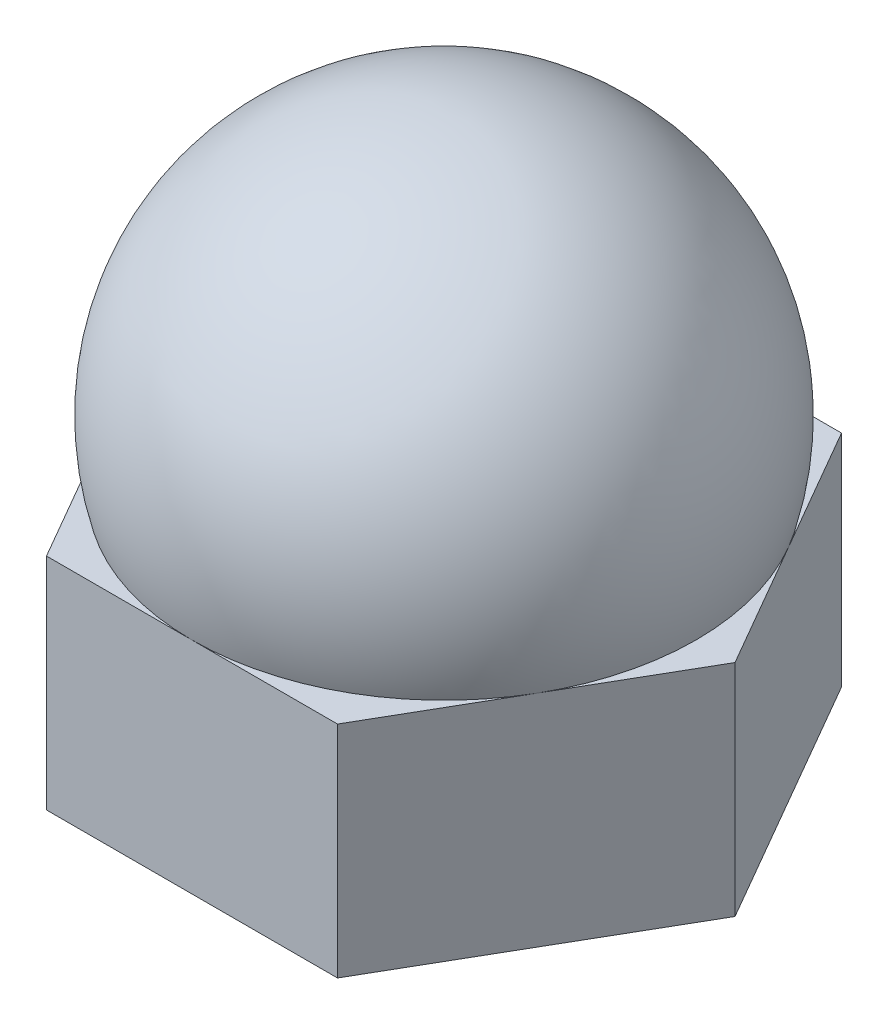
ISO-10303-21;
HEADER;
FILE_DESCRIPTION(('STEP AP214'),'2;1');
FILE_NAME('part.step','',(''),(''),'','','');
FILE_SCHEMA(('AUTOMOTIVE_DESIGN { 1 0 10303 214 1 1 1 1 }'));
ENDSEC;
DATA;
#1=APPLICATION_CONTEXT('core data for automotive mechanical design processes');
#2=APPLICATION_PROTOCOL_DEFINITION('international standard','automotive_design',2000,#1);
#3=PRODUCT_CONTEXT('',#1,'mechanical');
#4=PRODUCT('Part','Part','',(#3));
#5=PRODUCT_RELATED_PRODUCT_CATEGORY('part','',(#4));
#6=PRODUCT_DEFINITION_FORMATION('','',#4);
#7=PRODUCT_DEFINITION_CONTEXT('part definition',#1,'design');
#8=PRODUCT_DEFINITION('design','',#6,#7);
#9=PRODUCT_DEFINITION_SHAPE('','',#8);
#10=(LENGTH_UNIT() NAMED_UNIT(*) SI_UNIT(.MILLI.,.METRE.));
#11=(NAMED_UNIT(*) PLANE_ANGLE_UNIT() SI_UNIT($,.RADIAN.));
#12=(NAMED_UNIT(*) SI_UNIT($,.STERADIAN.) SOLID_ANGLE_UNIT());
#13=UNCERTAINTY_MEASURE_WITH_UNIT(LENGTH_MEASURE(1.E-05),#10,'distance_accuracy_value','');
#14=(GEOMETRIC_REPRESENTATION_CONTEXT(3) GLOBAL_UNCERTAINTY_ASSIGNED_CONTEXT((#13)) GLOBAL_UNIT_ASSIGNED_CONTEXT((#10,
#11,#12)) REPRESENTATION_CONTEXT('',''));
#15=CARTESIAN_POINT('',(0.,0.,0.));
#16=DIRECTION('',(0.,0.,1.));
#17=DIRECTION('',(1.,0.,0.));
#18=AXIS2_PLACEMENT_3D('',#15,#16,#17);
#19=CARTESIAN_POINT('',(-1.58771324027148,2.4,-2.75000000000001));
#20=DIRECTION('',(0.,1.,0.));
#21=DIRECTION('',(0.,0.,1.));
#22=AXIS2_PLACEMENT_3D('',#19,#20,#21);
#23=PLANE('',#22);
#24=DIRECTION('',(1.,0.,0.));
#25=VECTOR('',#24,1.);
#26=CARTESIAN_POINT('',(-1.58771324027148,2.4,2.74999999999999));
#27=LINE('',#26,#25);
#28=CARTESIAN_POINT('',(-1.58771324027148,2.4,2.74999999999999));
#29=VERTEX_POINT('',#28);
#30=CARTESIAN_POINT('',(0.,2.4,2.74999999999999));
#31=VERTEX_POINT('',#30);
#32=EDGE_CURVE('E118',#29,#31,#27,.T.);
#33=ORIENTED_EDGE('',*,*,#32,.T.);
#34=CARTESIAN_POINT('',(0.,2.4,0.));
#35=DIRECTION('',(0.,1.,0.));
#36=DIRECTION('',(0.,0.,1.));
#37=AXIS2_PLACEMENT_3D('',#34,#35,#36);
#38=CIRCLE('',#37,2.74999999999999);
#39=CARTESIAN_POINT('',(-2.38156986040721,2.4,1.375));
#40=VERTEX_POINT('',#39);
#41=EDGE_CURVE('E49',#40,#31,#38,.T.);
#42=ORIENTED_EDGE('',*,*,#41,.F.);
#43=DIRECTION('',(0.5,0.,0.866025403784438));
#44=VECTOR('',#43,1.);
#45=CARTESIAN_POINT('',(-3.17542648054295,2.4,0.));
#46=LINE('',#45,#44);
#47=EDGE_CURVE('E194',#40,#29,#46,.T.);
#48=ORIENTED_EDGE('',*,*,#47,.T.);
#49=EDGE_LOOP('',(#33,#42,#48));
#50=FACE_BOUND('',#49,.T.);
#51=ADVANCED_FACE('F34',(#50),#23,.T.);
#52=CARTESIAN_POINT('',(-3.17542648054295,2.4,0.));
#53=VERTEX_POINT('',#52);
#54=EDGE_CURVE('E119',#53,#40,#46,.T.);
#55=ORIENTED_EDGE('',*,*,#54,.T.);
#56=CARTESIAN_POINT('',(-2.38156986040722,2.4,-1.37500000000001));
#57=VERTEX_POINT('',#56);
#58=EDGE_CURVE('E189',#57,#40,#38,.T.);
#59=ORIENTED_EDGE('',*,*,#58,.F.);
#60=DIRECTION('',(-0.5,0.,0.866025403784439));
#61=VECTOR('',#60,1.);
#62=CARTESIAN_POINT('',(-1.58771324027148,2.4,-2.75000000000001));
#63=LINE('',#62,#61);
#64=EDGE_CURVE('E197',#57,#53,#63,.T.);
#65=ORIENTED_EDGE('',*,*,#64,.T.);
#66=EDGE_LOOP('',(#55,#59,#65));
#67=FACE_BOUND('',#66,.T.);
#68=ADVANCED_FACE('F196',(#67),#23,.T.);
#69=CARTESIAN_POINT('',(-1.58771324027148,2.4,-2.75000000000001));
#70=VERTEX_POINT('',#69);
#71=EDGE_CURVE('E195',#70,#57,#63,.T.);
#72=ORIENTED_EDGE('',*,*,#71,.T.);
#73=CARTESIAN_POINT('',(0.,2.4,-2.75));
#74=VERTEX_POINT('',#73);
#75=EDGE_CURVE('E187',#74,#57,#38,.T.);
#76=ORIENTED_EDGE('',*,*,#75,.F.);
#77=DIRECTION('',(-1.,0.,0.));
#78=VECTOR('',#77,1.);
#79=CARTESIAN_POINT('',(1.58771324027146,2.4,-2.75));
#80=LINE('',#79,#78);
#81=EDGE_CURVE('E95',#74,#70,#80,.T.);
#82=ORIENTED_EDGE('',*,*,#81,.T.);
#83=EDGE_LOOP('',(#72,#76,#82));
#84=FACE_BOUND('',#83,.T.);
#85=ADVANCED_FACE('F207',(#84),#23,.T.);
#86=CARTESIAN_POINT('',(1.58771324027146,2.4,-2.75));
#87=VERTEX_POINT('',#86);
#88=EDGE_CURVE('E200',#87,#74,#80,.T.);
#89=ORIENTED_EDGE('',*,*,#88,.T.);
#90=CARTESIAN_POINT('',(2.3815698604072,2.4,-1.375));
#91=VERTEX_POINT('',#90);
#92=EDGE_CURVE('E206',#91,#74,#38,.T.);
#93=ORIENTED_EDGE('',*,*,#92,.F.);
#94=DIRECTION('',(-0.5,0.,-0.866025403784439));
#95=VECTOR('',#94,1.);
#96=CARTESIAN_POINT('',(3.17542648054293,2.4,0.));
#97=LINE('',#96,#95);
#98=EDGE_CURVE('E58',#91,#87,#97,.T.);
#99=ORIENTED_EDGE('',*,*,#98,.T.);
#100=EDGE_LOOP('',(#89,#93,#99));
#101=FACE_BOUND('',#100,.T.);
#102=ADVANCED_FACE('F211',(#101),#23,.T.);
#103=CARTESIAN_POINT('',(3.17542648054293,2.4,0.));
#104=VERTEX_POINT('',#103);
#105=EDGE_CURVE('E137',#104,#91,#97,.T.);
#106=ORIENTED_EDGE('',*,*,#105,.T.);
#107=CARTESIAN_POINT('',(2.3815698604072,2.4,1.375));
#108=VERTEX_POINT('',#107);
#109=EDGE_CURVE('E179',#108,#91,#38,.T.);
#110=ORIENTED_EDGE('',*,*,#109,.F.);
#111=DIRECTION('',(0.500000000000001,0.,-0.866025403784438));
#112=VECTOR('',#111,1.);
#113=CARTESIAN_POINT('',(1.58771324027147,2.4,2.74999999999999));
#114=LINE('',#113,#112);
#115=EDGE_CURVE('E135',#108,#104,#114,.T.);
#116=ORIENTED_EDGE('',*,*,#115,.T.);
#117=EDGE_LOOP('',(#106,#110,#116));
#118=FACE_BOUND('',#117,.T.);
#119=ADVANCED_FACE('F177',(#118),#23,.T.);
#120=CARTESIAN_POINT('',(1.58771324027147,2.4,2.74999999999999));
#121=VERTEX_POINT('',#120);
#122=EDGE_CURVE('E113',#121,#108,#114,.T.);
#123=ORIENTED_EDGE('',*,*,#122,.T.);
#124=EDGE_CURVE('E114',#31,#108,#38,.T.);
#125=ORIENTED_EDGE('',*,*,#124,.F.);
#126=EDGE_CURVE('E108',#31,#121,#27,.T.);
#127=ORIENTED_EDGE('',*,*,#126,.T.);
#128=EDGE_LOOP('',(#123,#125,#127));
#129=FACE_BOUND('',#128,.T.);
#130=ADVANCED_FACE('F110',(#129),#23,.T.);
#131=CARTESIAN_POINT('',(-1.58771324027148,0.,-2.75000000000001));
#132=DIRECTION('',(0.,1.,0.));
#133=DIRECTION('',(0.,0.,1.));
#134=AXIS2_PLACEMENT_3D('',#131,#132,#133);
#135=PLANE('',#134);
#136=DIRECTION('',(-1.,0.,0.));
#137=VECTOR('',#136,1.);
#138=CARTESIAN_POINT('',(1.58771324027146,0.,-2.75));
#139=LINE('',#138,#137);
#140=CARTESIAN_POINT('',(1.58771324027146,0.,-2.75));
#141=VERTEX_POINT('',#140);
#142=CARTESIAN_POINT('',(-1.58771324027148,0.,-2.75000000000001));
#143=VERTEX_POINT('',#142);
#144=EDGE_CURVE('E143',#141,#143,#139,.T.);
#145=ORIENTED_EDGE('',*,*,#144,.F.);
#146=DIRECTION('',(-0.5,0.,-0.866025403784439));
#147=VECTOR('',#146,1.);
#148=CARTESIAN_POINT('',(3.17542648054293,0.,0.));
#149=LINE('',#148,#147);
#150=CARTESIAN_POINT('',(3.17542648054293,0.,0.));
#151=VERTEX_POINT('',#150);
#152=EDGE_CURVE('E86',#151,#141,#149,.T.);
#153=ORIENTED_EDGE('',*,*,#152,.F.);
#154=DIRECTION('',(0.500000000000001,0.,-0.866025403784438));
#155=VECTOR('',#154,1.);
#156=CARTESIAN_POINT('',(1.58771324027147,0.,2.74999999999999));
#157=LINE('',#156,#155);
#158=CARTESIAN_POINT('',(1.58771324027147,0.,2.74999999999999));
#159=VERTEX_POINT('',#158);
#160=EDGE_CURVE('E152',#159,#151,#157,.T.);
#161=ORIENTED_EDGE('',*,*,#160,.F.);
#162=DIRECTION('',(1.,0.,0.));
#163=VECTOR('',#162,1.);
#164=CARTESIAN_POINT('',(-1.58771324027148,0.,2.74999999999999));
#165=LINE('',#164,#163);
#166=CARTESIAN_POINT('',(-1.58771324027148,0.,2.74999999999999));
#167=VERTEX_POINT('',#166);
#168=EDGE_CURVE('E126',#167,#159,#165,.T.);
#169=ORIENTED_EDGE('',*,*,#168,.F.);
#170=DIRECTION('',(0.5,0.,0.866025403784438));
#171=VECTOR('',#170,1.);
#172=CARTESIAN_POINT('',(-3.17542648054295,0.,0.));
#173=LINE('',#172,#171);
#174=CARTESIAN_POINT('',(-3.17542648054295,0.,0.));
#175=VERTEX_POINT('',#174);
#176=EDGE_CURVE('E149',#175,#167,#173,.T.);
#177=ORIENTED_EDGE('',*,*,#176,.F.);
#178=DIRECTION('',(-0.5,0.,0.866025403784439));
#179=VECTOR('',#178,1.);
#180=CARTESIAN_POINT('',(-1.58771324027148,0.,-2.75000000000001));
#181=LINE('',#180,#179);
#182=EDGE_CURVE('E146',#143,#175,#181,.T.);
#183=ORIENTED_EDGE('',*,*,#182,.F.);
#184=EDGE_LOOP('',(#145,#153,#161,#169,#177,#183));
#185=FACE_BOUND('',#184,.T.);
#186=CARTESIAN_POINT('',(0.,0.,0.));
#187=DIRECTION('',(0.,1.,0.));
#188=DIRECTION('',(0.,0.,1.));
#189=AXIS2_PLACEMENT_3D('',#186,#187,#188);
#190=CIRCLE('',#189,1.25);
#191=CARTESIAN_POINT('',(0.,0.,1.25));
#192=VERTEX_POINT('',#191);
#193=EDGE_CURVE('E147',#192,#192,#190,.T.);
#194=ORIENTED_EDGE('',*,*,#193,.T.);
#195=EDGE_LOOP('',(#194));
#196=FACE_BOUND('',#195,.T.);
#197=ADVANCED_FACE('F170',(#185,#196),#135,.F.);
#198=CARTESIAN_POINT('',(1.58771324027146,2.4,-2.75));
#199=DIRECTION('',(0.,0.,1.));
#200=DIRECTION('',(1.,0.,0.));
#201=AXIS2_PLACEMENT_3D('',#198,#199,#200);
#202=PLANE('',#201);
#203=ORIENTED_EDGE('',*,*,#144,.T.);
#204=DIRECTION('',(0.,-1.,0.));
#205=VECTOR('',#204,1.);
#206=CARTESIAN_POINT('',(-1.58771324027148,2.4,-2.75000000000001));
#207=LINE('',#206,#205);
#208=EDGE_CURVE('E11',#70,#143,#207,.T.);
#209=ORIENTED_EDGE('',*,*,#208,.F.);
#210=ORIENTED_EDGE('',*,*,#81,.F.);
#211=ORIENTED_EDGE('',*,*,#88,.F.);
#212=DIRECTION('',(0.,-1.,0.));
#213=VECTOR('',#212,1.);
#214=CARTESIAN_POINT('',(1.58771324027146,2.4,-2.75));
#215=LINE('',#214,#213);
#216=EDGE_CURVE('E142',#87,#141,#215,.T.);
#217=ORIENTED_EDGE('',*,*,#216,.T.);
#218=EDGE_LOOP('',(#203,#209,#210,#211,#217));
#219=FACE_BOUND('',#218,.T.);
#220=ADVANCED_FACE('F36',(#219),#202,.F.);
#221=CARTESIAN_POINT('',(-1.58771324027148,2.4,-2.75000000000001));
#222=DIRECTION('',(0.866025403784439,0.,0.5));
#223=DIRECTION('',(0.5,0.,-0.866025403784439));
#224=AXIS2_PLACEMENT_3D('',#221,#222,#223);
#225=PLANE('',#224);
#226=ORIENTED_EDGE('',*,*,#182,.T.);
#227=DIRECTION('',(0.,-1.,0.));
#228=VECTOR('',#227,1.);
#229=CARTESIAN_POINT('',(-3.17542648054295,2.4,0.));
#230=LINE('',#229,#228);
#231=EDGE_CURVE('E42',#53,#175,#230,.T.);
#232=ORIENTED_EDGE('',*,*,#231,.F.);
#233=ORIENTED_EDGE('',*,*,#64,.F.);
#234=ORIENTED_EDGE('',*,*,#71,.F.);
#235=ORIENTED_EDGE('',*,*,#208,.T.);
#236=EDGE_LOOP('',(#226,#232,#233,#234,#235));
#237=FACE_BOUND('',#236,.T.);
#238=ADVANCED_FACE('F231',(#237),#225,.F.);
#239=CARTESIAN_POINT('',(-3.17542648054295,2.4,0.));
#240=DIRECTION('',(0.866025403784438,0.,-0.5));
#241=DIRECTION('',(-0.5,0.,-0.866025403784439));
#242=AXIS2_PLACEMENT_3D('',#239,#240,#241);
#243=PLANE('',#242);
#244=ORIENTED_EDGE('',*,*,#176,.T.);
#245=DIRECTION('',(0.,-1.,0.));
#246=VECTOR('',#245,1.);
#247=CARTESIAN_POINT('',(-1.58771324027148,2.4,2.74999999999999));
#248=LINE('',#247,#246);
#249=EDGE_CURVE('E129',#29,#167,#248,.T.);
#250=ORIENTED_EDGE('',*,*,#249,.F.);
#251=ORIENTED_EDGE('',*,*,#47,.F.);
#252=ORIENTED_EDGE('',*,*,#54,.F.);
#253=ORIENTED_EDGE('',*,*,#231,.T.);
#254=EDGE_LOOP('',(#244,#250,#251,#252,#253));
#255=FACE_BOUND('',#254,.T.);
#256=ADVANCED_FACE('F162',(#255),#243,.F.);
#257=CARTESIAN_POINT('',(-1.58771324027148,2.4,2.74999999999999));
#258=DIRECTION('',(0.,0.,-1.));
#259=DIRECTION('',(-1.,0.,0.));
#260=AXIS2_PLACEMENT_3D('',#257,#258,#259);
#261=PLANE('',#260);
#262=ORIENTED_EDGE('',*,*,#168,.T.);
#263=DIRECTION('',(0.,-1.,0.));
#264=VECTOR('',#263,1.);
#265=CARTESIAN_POINT('',(1.58771324027147,2.4,2.74999999999999));
#266=LINE('',#265,#264);
#267=EDGE_CURVE('E122',#121,#159,#266,.T.);
#268=ORIENTED_EDGE('',*,*,#267,.F.);
#269=ORIENTED_EDGE('',*,*,#126,.F.);
#270=ORIENTED_EDGE('',*,*,#32,.F.);
#271=ORIENTED_EDGE('',*,*,#249,.T.);
#272=EDGE_LOOP('',(#262,#268,#269,#270,#271));
#273=FACE_BOUND('',#272,.T.);
#274=ADVANCED_FACE('F123',(#273),#261,.F.);
#275=CARTESIAN_POINT('',(1.58771324027147,2.4,2.74999999999999));
#276=DIRECTION('',(-0.866025403784438,0.,-0.500000000000001));
#277=DIRECTION('',(-0.500000000000001,0.,0.866025403784438));
#278=AXIS2_PLACEMENT_3D('',#275,#276,#277);
#279=PLANE('',#278);
#280=ORIENTED_EDGE('',*,*,#160,.T.);
#281=DIRECTION('',(0.,-1.,0.));
#282=VECTOR('',#281,1.);
#283=CARTESIAN_POINT('',(3.17542648054293,2.4,0.));
#284=LINE('',#283,#282);
#285=EDGE_CURVE('E130',#104,#151,#284,.T.);
#286=ORIENTED_EDGE('',*,*,#285,.F.);
#287=ORIENTED_EDGE('',*,*,#115,.F.);
#288=ORIENTED_EDGE('',*,*,#122,.F.);
#289=ORIENTED_EDGE('',*,*,#267,.T.);
#290=EDGE_LOOP('',(#280,#286,#287,#288,#289));
#291=FACE_BOUND('',#290,.T.);
#292=ADVANCED_FACE('F133',(#291),#279,.F.);
#293=CARTESIAN_POINT('',(3.17542648054293,2.4,0.));
#294=DIRECTION('',(-0.866025403784439,0.,0.5));
#295=DIRECTION('',(0.5,0.,0.866025403784439));
#296=AXIS2_PLACEMENT_3D('',#293,#294,#295);
#297=PLANE('',#296);
#298=ORIENTED_EDGE('',*,*,#152,.T.);
#299=ORIENTED_EDGE('',*,*,#216,.F.);
#300=ORIENTED_EDGE('',*,*,#98,.F.);
#301=ORIENTED_EDGE('',*,*,#105,.F.);
#302=ORIENTED_EDGE('',*,*,#285,.T.);
#303=EDGE_LOOP('',(#298,#299,#300,#301,#302));
#304=FACE_BOUND('',#303,.T.);
#305=ADVANCED_FACE('F173',(#304),#297,.F.);
#306=CARTESIAN_POINT('',(0.,2.4,0.));
#307=DIRECTION('',(0.,-1.,0.));
#308=DIRECTION('',(0.,0.,-1.));
#309=AXIS2_PLACEMENT_3D('',#306,#307,#308);
#310=CYLINDRICAL_SURFACE('',#309,1.25);
#311=CARTESIAN_POINT('',(0.,2.4,0.));
#312=DIRECTION('',(0.,-1.,0.));
#313=DIRECTION('',(0.,0.,-1.));
#314=AXIS2_PLACEMENT_3D('',#311,#312,#313);
#315=CIRCLE('',#314,1.25);
#316=CARTESIAN_POINT('',(0.,2.4,-1.25));
#317=VERTEX_POINT('',#316);
#318=EDGE_CURVE('E204',#317,#317,#315,.T.);
#319=ORIENTED_EDGE('',*,*,#318,.F.);
#320=EDGE_LOOP('',(#319));
#321=FACE_BOUND('',#320,.T.);
#322=ORIENTED_EDGE('',*,*,#193,.F.);
#323=EDGE_LOOP('',(#322));
#324=FACE_BOUND('',#323,.T.);
#325=ADVANCED_FACE('F235',(#321,#324),#310,.F.);
#326=CARTESIAN_POINT('',(0.,2.4,0.));
#327=DIRECTION('',(0.,-1.,0.));
#328=DIRECTION('',(0.,0.,-1.));
#329=AXIS2_PLACEMENT_3D('',#326,#327,#328);
#330=PLANE('',#329);
#331=ORIENTED_EDGE('',*,*,#318,.T.);
#332=EDGE_LOOP('',(#331));
#333=FACE_BOUND('',#332,.T.);
#334=ADVANCED_FACE('F269',(#333),#330,.T.);
#335=CARTESIAN_POINT('',(0.,3.14965277777778,0.));
#336=DIRECTION('',(0.,1.,0.));
#337=DIRECTION('',(0.,0.,1.));
#338=AXIS2_PLACEMENT_3D('',#335,#336,#337);
#339=SPHERICAL_SURFACE('',#338,2.85034722222222);
#340=ORIENTED_EDGE('',*,*,#124,.T.);
#341=ORIENTED_EDGE('',*,*,#109,.T.);
#342=ORIENTED_EDGE('',*,*,#92,.T.);
#343=ORIENTED_EDGE('',*,*,#75,.T.);
#344=ORIENTED_EDGE('',*,*,#58,.T.);
#345=ORIENTED_EDGE('',*,*,#41,.T.);
#346=EDGE_LOOP('',(#340,#341,#342,#343,#344,#345));
#347=FACE_BOUND('',#346,.T.);
#348=ADVANCED_FACE('F190',(#347),#339,.T.);
#349=CLOSED_SHELL('',(#51,#68,#85,#102,#119,#130,#197,#220,#238,#256,#274,#292,#305,#325,#334,#348));
#350=MANIFOLD_SOLID_BREP('B2',#349);
#351=ADVANCED_BREP_SHAPE_REPRESENTATION('',(#18,#350),#14);
#352=SHAPE_DEFINITION_REPRESENTATION(#9,#351);
ENDSEC;
END-ISO-10303-21;
